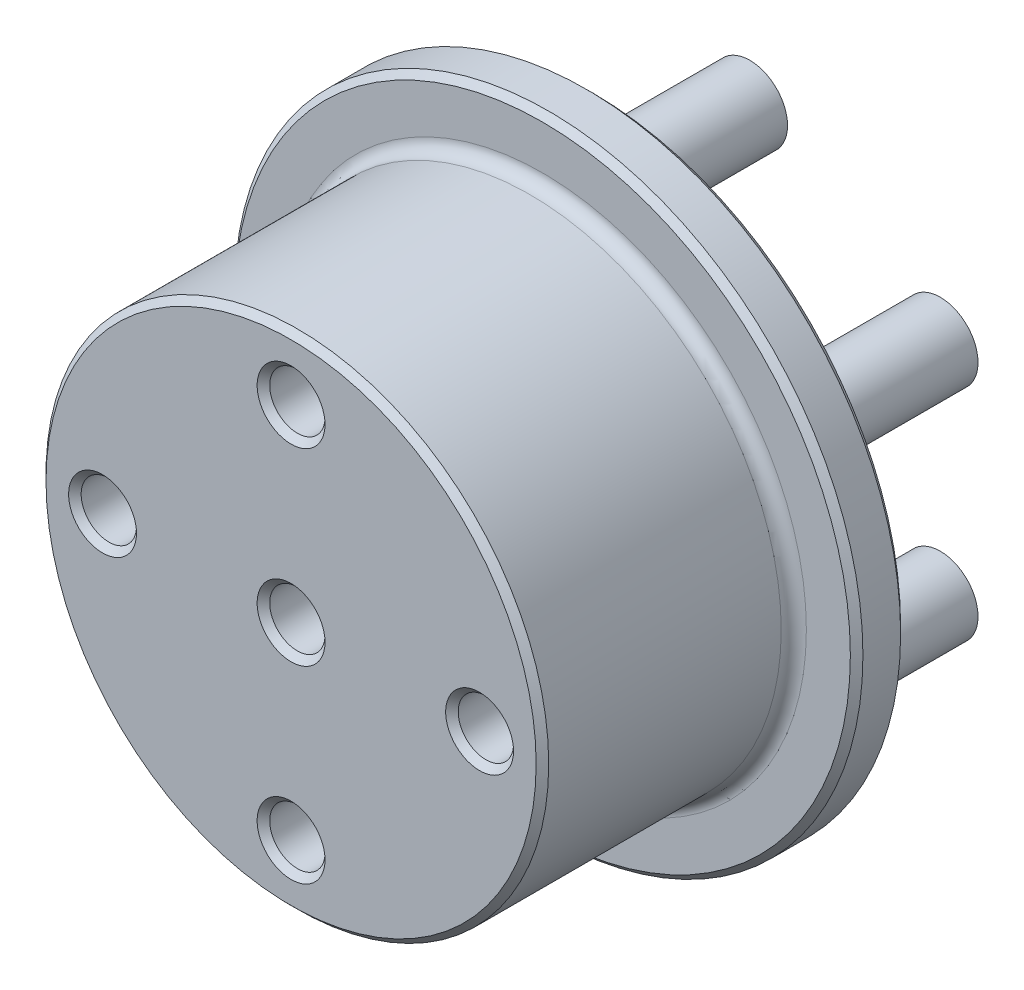
ISO-10303-21;
HEADER;
FILE_DESCRIPTION(('STEP AP214'),'2;1');
FILE_NAME('part.step','',(''),(''),'','','');
FILE_SCHEMA(('AUTOMOTIVE_DESIGN { 1 0 10303 214 1 1 1 1 }'));
ENDSEC;
DATA;
#1=APPLICATION_CONTEXT('core data for automotive mechanical design processes');
#2=APPLICATION_PROTOCOL_DEFINITION('international standard','automotive_design',2000,#1);
#3=PRODUCT_CONTEXT('',#1,'mechanical');
#4=PRODUCT('Part','Part','',(#3));
#5=PRODUCT_RELATED_PRODUCT_CATEGORY('part','',(#4));
#6=PRODUCT_DEFINITION_FORMATION('','',#4);
#7=PRODUCT_DEFINITION_CONTEXT('part definition',#1,'design');
#8=PRODUCT_DEFINITION('design','',#6,#7);
#9=PRODUCT_DEFINITION_SHAPE('','',#8);
#10=(LENGTH_UNIT() NAMED_UNIT(*) SI_UNIT(.MILLI.,.METRE.));
#11=(NAMED_UNIT(*) PLANE_ANGLE_UNIT() SI_UNIT($,.RADIAN.));
#12=(NAMED_UNIT(*) SI_UNIT($,.STERADIAN.) SOLID_ANGLE_UNIT());
#13=UNCERTAINTY_MEASURE_WITH_UNIT(LENGTH_MEASURE(1.E-05),#10,'distance_accuracy_value','');
#14=(GEOMETRIC_REPRESENTATION_CONTEXT(3) GLOBAL_UNCERTAINTY_ASSIGNED_CONTEXT((#13)) GLOBAL_UNIT_ASSIGNED_CONTEXT((#10,
#11,#12)) REPRESENTATION_CONTEXT('',''));
#15=CARTESIAN_POINT('',(0.,0.,0.));
#16=DIRECTION('',(0.,0.,1.));
#17=DIRECTION('',(1.,0.,0.));
#18=AXIS2_PLACEMENT_3D('',#15,#16,#17);
#19=CARTESIAN_POINT('',(0.,0.,-4.));
#20=DIRECTION('',(0.,0.,1.));
#21=DIRECTION('',(1.,0.,0.));
#22=AXIS2_PLACEMENT_3D('',#19,#20,#21);
#23=CYLINDRICAL_SURFACE('',#22,25.);
#24=CARTESIAN_POINT('',(0.,0.,-3.49999999999999));
#25=DIRECTION('',(0.,0.,1.));
#26=DIRECTION('',(1.,0.,0.));
#27=AXIS2_PLACEMENT_3D('',#24,#25,#26);
#28=CIRCLE('',#27,25.);
#29=CARTESIAN_POINT('',(25.,0.,-3.49999999999999));
#30=VERTEX_POINT('',#29);
#31=EDGE_CURVE('E186',#30,#30,#28,.T.);
#32=ORIENTED_EDGE('',*,*,#31,.T.);
#33=EDGE_LOOP('',(#32));
#34=FACE_BOUND('',#33,.T.);
#35=CARTESIAN_POINT('',(0.,0.,-0.49999999999999));
#36=DIRECTION('',(0.,0.,1.));
#37=DIRECTION('',(1.,0.,0.));
#38=AXIS2_PLACEMENT_3D('',#35,#36,#37);
#39=CIRCLE('',#38,25.);
#40=CARTESIAN_POINT('',(25.,0.,-0.49999999999999));
#41=VERTEX_POINT('',#40);
#42=EDGE_CURVE('E182',#41,#41,#39,.F.);
#43=ORIENTED_EDGE('',*,*,#42,.T.);
#44=EDGE_LOOP('',(#43));
#45=FACE_BOUND('',#44,.T.);
#46=ADVANCED_FACE('F47',(#34,#45),#23,.T.);
#47=CARTESIAN_POINT('',(0.,0.,-4.));
#48=DIRECTION('',(0.,0.,1.));
#49=DIRECTION('',(1.,0.,0.));
#50=AXIS2_PLACEMENT_3D('',#47,#48,#49);
#51=PLANE('',#50);
#52=CARTESIAN_POINT('',(0.,0.,-4.));
#53=DIRECTION('',(0.,0.,1.));
#54=DIRECTION('',(1.,0.,0.));
#55=AXIS2_PLACEMENT_3D('',#52,#53,#54);
#56=CIRCLE('',#55,24.5);
#57=CARTESIAN_POINT('',(24.5,0.,-4.));
#58=VERTEX_POINT('',#57);
#59=EDGE_CURVE('E194',#58,#58,#56,.F.);
#60=ORIENTED_EDGE('',*,*,#59,.T.);
#61=EDGE_LOOP('',(#60));
#62=FACE_BOUND('',#61,.T.);
#63=CARTESIAN_POINT('',(0.,0.,-4.));
#64=DIRECTION('',(0.,0.,1.));
#65=DIRECTION('',(1.,0.,0.));
#66=AXIS2_PLACEMENT_3D('',#63,#64,#65);
#67=CIRCLE('',#66,10.7);
#68=CARTESIAN_POINT('',(10.7,0.,-4.));
#69=VERTEX_POINT('',#68);
#70=EDGE_CURVE('E190',#69,#69,#67,.T.);
#71=ORIENTED_EDGE('',*,*,#70,.T.);
#72=EDGE_LOOP('',(#71));
#73=FACE_BOUND('',#72,.T.);
#74=CARTESIAN_POINT('',(15.1554445662276,8.75000000000018,-4.));
#75=DIRECTION('',(0.,0.,1.));
#76=DIRECTION('',(1.,0.,0.));
#77=AXIS2_PLACEMENT_3D('',#74,#75,#76);
#78=CIRCLE('',#77,4.);
#79=CARTESIAN_POINT('',(19.1554445662276,8.75000000000018,-4.));
#80=VERTEX_POINT('',#79);
#81=EDGE_CURVE('E158',#80,#80,#78,.T.);
#82=ORIENTED_EDGE('',*,*,#81,.T.);
#83=EDGE_LOOP('',(#82));
#84=FACE_BOUND('',#83,.T.);
#85=CARTESIAN_POINT('',(0.,17.5,-4.));
#86=DIRECTION('',(0.,0.,1.));
#87=DIRECTION('',(1.,0.,0.));
#88=AXIS2_PLACEMENT_3D('',#85,#86,#87);
#89=CIRCLE('',#88,4.);
#90=CARTESIAN_POINT('',(4.,17.5,-4.));
#91=VERTEX_POINT('',#90);
#92=EDGE_CURVE('E154',#91,#91,#89,.T.);
#93=ORIENTED_EDGE('',*,*,#92,.T.);
#94=EDGE_LOOP('',(#93));
#95=FACE_BOUND('',#94,.T.);
#96=CARTESIAN_POINT('',(-15.1554445662277,8.74999999999997,-4.));
#97=DIRECTION('',(0.,0.,1.));
#98=DIRECTION('',(1.,0.,0.));
#99=AXIS2_PLACEMENT_3D('',#96,#97,#98);
#100=CIRCLE('',#99,4.);
#101=CARTESIAN_POINT('',(-11.1554445662277,8.74999999999997,-4.));
#102=VERTEX_POINT('',#101);
#103=EDGE_CURVE('E150',#102,#102,#100,.T.);
#104=ORIENTED_EDGE('',*,*,#103,.T.);
#105=EDGE_LOOP('',(#104));
#106=FACE_BOUND('',#105,.T.);
#107=CARTESIAN_POINT('',(-15.1554445662276,-8.75000000000007,-4.));
#108=DIRECTION('',(0.,0.,1.));
#109=DIRECTION('',(1.,0.,0.));
#110=AXIS2_PLACEMENT_3D('',#107,#108,#109);
#111=CIRCLE('',#110,4.);
#112=CARTESIAN_POINT('',(-11.1554445662276,-8.75000000000007,-4.));
#113=VERTEX_POINT('',#112);
#114=EDGE_CURVE('E146',#113,#113,#111,.T.);
#115=ORIENTED_EDGE('',*,*,#114,.T.);
#116=EDGE_LOOP('',(#115));
#117=FACE_BOUND('',#116,.T.);
#118=CARTESIAN_POINT('',(1.2220184685951E-13,-17.5,-4.));
#119=DIRECTION('',(0.,0.,1.));
#120=DIRECTION('',(1.,0.,0.));
#121=AXIS2_PLACEMENT_3D('',#118,#119,#120);
#122=CIRCLE('',#121,4.);
#123=CARTESIAN_POINT('',(4.00000000000012,-17.5,-4.));
#124=VERTEX_POINT('',#123);
#125=EDGE_CURVE('E142',#124,#124,#122,.T.);
#126=ORIENTED_EDGE('',*,*,#125,.T.);
#127=EDGE_LOOP('',(#126));
#128=FACE_BOUND('',#127,.T.);
#129=CARTESIAN_POINT('',(15.1554445662277,-8.75000000000001,-4.));
#130=DIRECTION('',(0.,0.,1.));
#131=DIRECTION('',(1.,0.,0.));
#132=AXIS2_PLACEMENT_3D('',#129,#130,#131);
#133=CIRCLE('',#132,4.);
#134=CARTESIAN_POINT('',(19.1554445662277,-8.75000000000001,-4.));
#135=VERTEX_POINT('',#134);
#136=EDGE_CURVE('E138',#135,#135,#133,.T.);
#137=ORIENTED_EDGE('',*,*,#136,.T.);
#138=EDGE_LOOP('',(#137));
#139=FACE_BOUND('',#138,.T.);
#140=ADVANCED_FACE('F274',(#62,#73,#84,#95,#106,#117,#128,#139),#51,.F.);
#141=CARTESIAN_POINT('',(0.,0.,0.));
#142=DIRECTION('',(0.,0.,1.));
#143=DIRECTION('',(1.,0.,0.));
#144=AXIS2_PLACEMENT_3D('',#141,#142,#143);
#145=PLANE('',#144);
#146=CARTESIAN_POINT('',(0.,0.,0.));
#147=DIRECTION('',(0.,0.,1.));
#148=DIRECTION('',(1.,0.,0.));
#149=AXIS2_PLACEMENT_3D('',#146,#147,#148);
#150=CIRCLE('',#149,24.5);
#151=CARTESIAN_POINT('',(24.5,0.,0.));
#152=VERTEX_POINT('',#151);
#153=EDGE_CURVE('E210',#152,#152,#150,.T.);
#154=ORIENTED_EDGE('',*,*,#153,.T.);
#155=EDGE_LOOP('',(#154));
#156=FACE_BOUND('',#155,.T.);
#157=CARTESIAN_POINT('',(0.,0.,0.));
#158=DIRECTION('',(0.,0.,1.));
#159=DIRECTION('',(1.,0.,0.));
#160=AXIS2_PLACEMENT_3D('',#157,#158,#159);
#161=CIRCLE('',#160,21.);
#162=CARTESIAN_POINT('',(21.,0.,0.));
#163=VERTEX_POINT('',#162);
#164=EDGE_CURVE('E130',#163,#163,#161,.F.);
#165=ORIENTED_EDGE('',*,*,#164,.T.);
#166=EDGE_LOOP('',(#165));
#167=FACE_BOUND('',#166,.T.);
#168=ADVANCED_FACE('F281',(#156,#167),#145,.T.);
#169=CARTESIAN_POINT('',(0.,0.,20.));
#170=DIRECTION('',(0.,0.,-1.));
#171=DIRECTION('',(-1.,0.,0.));
#172=AXIS2_PLACEMENT_3D('',#169,#170,#171);
#173=CYLINDRICAL_SURFACE('',#172,20.);
#174=CARTESIAN_POINT('',(0.,0.,19.5));
#175=DIRECTION('',(0.,0.,1.));
#176=DIRECTION('',(1.,0.,0.));
#177=AXIS2_PLACEMENT_3D('',#174,#175,#176);
#178=CIRCLE('',#177,20.);
#179=CARTESIAN_POINT('',(20.,0.,19.5));
#180=VERTEX_POINT('',#179);
#181=EDGE_CURVE('E238',#180,#180,#178,.F.);
#182=ORIENTED_EDGE('',*,*,#181,.T.);
#183=EDGE_LOOP('',(#182));
#184=FACE_BOUND('',#183,.T.);
#185=CARTESIAN_POINT('',(0.,0.,1.));
#186=DIRECTION('',(0.,0.,1.));
#187=DIRECTION('',(1.,0.,0.));
#188=AXIS2_PLACEMENT_3D('',#185,#186,#187);
#189=CIRCLE('',#188,20.);
#190=CARTESIAN_POINT('',(20.,0.,1.));
#191=VERTEX_POINT('',#190);
#192=EDGE_CURVE('E107',#191,#191,#189,.T.);
#193=ORIENTED_EDGE('',*,*,#192,.T.);
#194=EDGE_LOOP('',(#193));
#195=FACE_BOUND('',#194,.T.);
#196=ADVANCED_FACE('F455',(#184,#195),#173,.T.);
#197=CARTESIAN_POINT('',(0.,0.,20.));
#198=DIRECTION('',(0.,0.,1.));
#199=DIRECTION('',(1.,0.,0.));
#200=AXIS2_PLACEMENT_3D('',#197,#198,#199);
#201=PLANE('',#200);
#202=CARTESIAN_POINT('',(0.,0.,20.));
#203=DIRECTION('',(0.,0.,1.));
#204=DIRECTION('',(1.,0.,0.));
#205=AXIS2_PLACEMENT_3D('',#202,#203,#204);
#206=CIRCLE('',#205,19.5);
#207=CARTESIAN_POINT('',(19.5,0.,20.));
#208=VERTEX_POINT('',#207);
#209=EDGE_CURVE('E234',#208,#208,#206,.T.);
#210=ORIENTED_EDGE('',*,*,#209,.T.);
#211=EDGE_LOOP('',(#210));
#212=FACE_BOUND('',#211,.T.);
#213=CARTESIAN_POINT('',(-15.,0.,20.));
#214=DIRECTION('',(0.,0.,1.));
#215=DIRECTION('',(1.,0.,0.));
#216=AXIS2_PLACEMENT_3D('',#213,#214,#215);
#217=CIRCLE('',#216,2.70000000000002);
#218=CARTESIAN_POINT('',(-12.3,0.,20.));
#219=VERTEX_POINT('',#218);
#220=EDGE_CURVE('E230',#219,#219,#217,.F.);
#221=ORIENTED_EDGE('',*,*,#220,.T.);
#222=EDGE_LOOP('',(#221));
#223=FACE_BOUND('',#222,.T.);
#224=CARTESIAN_POINT('',(0.,-15.,20.));
#225=DIRECTION('',(0.,0.,1.));
#226=DIRECTION('',(1.,0.,0.));
#227=AXIS2_PLACEMENT_3D('',#224,#225,#226);
#228=CIRCLE('',#227,2.70000000000002);
#229=CARTESIAN_POINT('',(2.70000000000002,-15.,20.));
#230=VERTEX_POINT('',#229);
#231=EDGE_CURVE('E226',#230,#230,#228,.F.);
#232=ORIENTED_EDGE('',*,*,#231,.T.);
#233=EDGE_LOOP('',(#232));
#234=FACE_BOUND('',#233,.T.);
#235=CARTESIAN_POINT('',(15.,0.,20.));
#236=DIRECTION('',(0.,0.,1.));
#237=DIRECTION('',(1.,0.,0.));
#238=AXIS2_PLACEMENT_3D('',#235,#236,#237);
#239=CIRCLE('',#238,2.70000000000002);
#240=CARTESIAN_POINT('',(17.7,0.,20.));
#241=VERTEX_POINT('',#240);
#242=EDGE_CURVE('E222',#241,#241,#239,.F.);
#243=ORIENTED_EDGE('',*,*,#242,.T.);
#244=EDGE_LOOP('',(#243));
#245=FACE_BOUND('',#244,.T.);
#246=CARTESIAN_POINT('',(0.,15.,20.));
#247=DIRECTION('',(0.,0.,1.));
#248=DIRECTION('',(1.,0.,0.));
#249=AXIS2_PLACEMENT_3D('',#246,#247,#248);
#250=CIRCLE('',#249,2.70000000000002);
#251=CARTESIAN_POINT('',(2.70000000000002,15.,20.));
#252=VERTEX_POINT('',#251);
#253=EDGE_CURVE('E218',#252,#252,#250,.F.);
#254=ORIENTED_EDGE('',*,*,#253,.T.);
#255=EDGE_LOOP('',(#254));
#256=FACE_BOUND('',#255,.T.);
#257=CARTESIAN_POINT('',(0.,0.,20.));
#258=DIRECTION('',(0.,0.,1.));
#259=DIRECTION('',(1.,0.,0.));
#260=AXIS2_PLACEMENT_3D('',#257,#258,#259);
#261=CIRCLE('',#260,2.70000000000002);
#262=CARTESIAN_POINT('',(2.70000000000002,0.,20.));
#263=VERTEX_POINT('',#262);
#264=EDGE_CURVE('E214',#263,#263,#261,.F.);
#265=ORIENTED_EDGE('',*,*,#264,.T.);
#266=EDGE_LOOP('',(#265));
#267=FACE_BOUND('',#266,.T.);
#268=ADVANCED_FACE('F291',(#212,#223,#234,#245,#256,#267),#201,.T.);
#269=CARTESIAN_POINT('',(0.,0.,1.));
#270=DIRECTION('',(0.,0.,1.));
#271=DIRECTION('',(1.,0.,0.));
#272=AXIS2_PLACEMENT_3D('',#269,#270,#271);
#273=TOROIDAL_SURFACE('',#272,21.,1.);
#274=ORIENTED_EDGE('',*,*,#164,.F.);
#275=EDGE_LOOP('',(#274));
#276=FACE_BOUND('',#275,.T.);
#277=ORIENTED_EDGE('',*,*,#192,.F.);
#278=EDGE_LOOP('',(#277));
#279=FACE_BOUND('',#278,.T.);
#280=ADVANCED_FACE('F287',(#276,#279),#273,.F.);
#281=CARTESIAN_POINT('',(0.,0.,1.));
#282=DIRECTION('',(0.,0.,-1.));
#283=DIRECTION('',(-1.,0.,0.));
#284=AXIS2_PLACEMENT_3D('',#281,#282,#283);
#285=CYLINDRICAL_SURFACE('',#284,10.2);
#286=CARTESIAN_POINT('',(0.,0.,-3.49999999999999));
#287=DIRECTION('',(0.,0.,1.));
#288=DIRECTION('',(1.,0.,0.));
#289=AXIS2_PLACEMENT_3D('',#286,#287,#288);
#290=CIRCLE('',#289,10.2);
#291=CARTESIAN_POINT('',(10.2,0.,-3.49999999999999));
#292=VERTEX_POINT('',#291);
#293=EDGE_CURVE('E202',#292,#292,#290,.F.);
#294=ORIENTED_EDGE('',*,*,#293,.T.);
#295=EDGE_LOOP('',(#294));
#296=FACE_BOUND('',#295,.T.);
#297=CARTESIAN_POINT('',(0.,0.,0.500000000000003));
#298=DIRECTION('',(0.,0.,-1.));
#299=DIRECTION('',(-1.,0.,0.));
#300=AXIS2_PLACEMENT_3D('',#297,#298,#299);
#301=CIRCLE('',#300,10.2);
#302=CARTESIAN_POINT('',(-10.2,0.,0.500000000000003));
#303=VERTEX_POINT('',#302);
#304=EDGE_CURVE('E198',#303,#303,#301,.F.);
#305=ORIENTED_EDGE('',*,*,#304,.T.);
#306=EDGE_LOOP('',(#305));
#307=FACE_BOUND('',#306,.T.);
#308=ADVANCED_FACE('F290',(#296,#307),#285,.F.);
#309=CARTESIAN_POINT('',(0.,0.,1.));
#310=DIRECTION('',(0.,0.,-1.));
#311=DIRECTION('',(-1.,0.,0.));
#312=AXIS2_PLACEMENT_3D('',#309,#310,#311);
#313=PLANE('',#312);
#314=CARTESIAN_POINT('',(0.,0.,1.));
#315=DIRECTION('',(0.,0.,-1.));
#316=DIRECTION('',(-1.,0.,0.));
#317=AXIS2_PLACEMENT_3D('',#314,#315,#316);
#318=CIRCLE('',#317,9.69999999999999);
#319=CARTESIAN_POINT('',(-9.69999999999999,0.,1.));
#320=VERTEX_POINT('',#319);
#321=EDGE_CURVE('E206',#320,#320,#318,.T.);
#322=ORIENTED_EDGE('',*,*,#321,.T.);
#323=EDGE_LOOP('',(#322));
#324=FACE_BOUND('',#323,.T.);
#325=ADVANCED_FACE('F421',(#324),#313,.T.);
#326=CARTESIAN_POINT('',(-15.1554445662277,8.74999999999997,-16.5));
#327=DIRECTION('',(0.,0.,1.));
#328=DIRECTION('',(1.,0.,0.));
#329=AXIS2_PLACEMENT_3D('',#326,#327,#328);
#330=CYLINDRICAL_SURFACE('',#329,3.);
#331=CARTESIAN_POINT('',(-15.1554445662277,8.74999999999997,-5.));
#332=DIRECTION('',(0.,0.,1.));
#333=DIRECTION('',(1.,0.,0.));
#334=AXIS2_PLACEMENT_3D('',#331,#332,#333);
#335=CIRCLE('',#334,3.);
#336=CARTESIAN_POINT('',(-12.1554445662277,8.74999999999997,-5.));
#337=VERTEX_POINT('',#336);
#338=EDGE_CURVE('E166',#337,#337,#335,.F.);
#339=ORIENTED_EDGE('',*,*,#338,.T.);
#340=EDGE_LOOP('',(#339));
#341=FACE_BOUND('',#340,.T.);
#342=CARTESIAN_POINT('',(-15.1554445662277,8.74999999999997,-16.5));
#343=DIRECTION('',(0.,0.,-1.));
#344=DIRECTION('',(-1.,0.,0.));
#345=AXIS2_PLACEMENT_3D('',#342,#343,#344);
#346=CIRCLE('',#345,3.);
#347=CARTESIAN_POINT('',(-18.1554445662277,8.74999999999997,-16.5));
#348=VERTEX_POINT('',#347);
#349=EDGE_CURVE('E108',#348,#348,#346,.T.);
#350=ORIENTED_EDGE('',*,*,#349,.F.);
#351=EDGE_LOOP('',(#350));
#352=FACE_BOUND('',#351,.T.);
#353=ADVANCED_FACE('F417',(#341,#352),#330,.T.);
#354=CARTESIAN_POINT('',(-15.1554445662277,8.74999999999997,-16.5));
#355=DIRECTION('',(0.,0.,-1.));
#356=DIRECTION('',(-1.,0.,0.));
#357=AXIS2_PLACEMENT_3D('',#354,#355,#356);
#358=PLANE('',#357);
#359=ORIENTED_EDGE('',*,*,#349,.T.);
#360=EDGE_LOOP('',(#359));
#361=FACE_BOUND('',#360,.T.);
#362=ADVANCED_FACE('F420',(#361),#358,.T.);
#363=CARTESIAN_POINT('',(-15.1554445662276,-8.75000000000007,-16.5));
#364=DIRECTION('',(0.,0.,1.));
#365=DIRECTION('',(1.,0.,0.));
#366=AXIS2_PLACEMENT_3D('',#363,#364,#365);
#367=CYLINDRICAL_SURFACE('',#366,3.);
#368=CARTESIAN_POINT('',(-15.1554445662276,-8.75000000000007,-5.));
#369=DIRECTION('',(0.,0.,1.));
#370=DIRECTION('',(1.,0.,0.));
#371=AXIS2_PLACEMENT_3D('',#368,#369,#370);
#372=CIRCLE('',#371,3.);
#373=CARTESIAN_POINT('',(-12.1554445662276,-8.75000000000007,-5.));
#374=VERTEX_POINT('',#373);
#375=EDGE_CURVE('E170',#374,#374,#372,.F.);
#376=ORIENTED_EDGE('',*,*,#375,.T.);
#377=EDGE_LOOP('',(#376));
#378=FACE_BOUND('',#377,.T.);
#379=CARTESIAN_POINT('',(-15.1554445662276,-8.75000000000007,-16.5));
#380=DIRECTION('',(0.,0.,-1.));
#381=DIRECTION('',(-1.,0.,0.));
#382=AXIS2_PLACEMENT_3D('',#379,#380,#381);
#383=CIRCLE('',#382,3.);
#384=CARTESIAN_POINT('',(-18.1554445662276,-8.75000000000007,-16.5));
#385=VERTEX_POINT('',#384);
#386=EDGE_CURVE('E116',#385,#385,#383,.T.);
#387=ORIENTED_EDGE('',*,*,#386,.F.);
#388=EDGE_LOOP('',(#387));
#389=FACE_BOUND('',#388,.T.);
#390=ADVANCED_FACE('F425',(#378,#389),#367,.T.);
#391=CARTESIAN_POINT('',(-15.1554445662276,-8.75000000000007,-16.5));
#392=DIRECTION('',(0.,0.,-1.));
#393=DIRECTION('',(-1.,0.,0.));
#394=AXIS2_PLACEMENT_3D('',#391,#392,#393);
#395=PLANE('',#394);
#396=ORIENTED_EDGE('',*,*,#386,.T.);
#397=EDGE_LOOP('',(#396));
#398=FACE_BOUND('',#397,.T.);
#399=ADVANCED_FACE('F429',(#398),#395,.T.);
#400=CARTESIAN_POINT('',(1.2220184685951E-13,-17.5,-16.5));
#401=DIRECTION('',(0.,0.,1.));
#402=DIRECTION('',(1.,0.,0.));
#403=AXIS2_PLACEMENT_3D('',#400,#401,#402);
#404=CYLINDRICAL_SURFACE('',#403,3.);
#405=CARTESIAN_POINT('',(1.2220184685951E-13,-17.5,-5.));
#406=DIRECTION('',(0.,0.,1.));
#407=DIRECTION('',(1.,0.,0.));
#408=AXIS2_PLACEMENT_3D('',#405,#406,#407);
#409=CIRCLE('',#408,3.);
#410=CARTESIAN_POINT('',(3.00000000000012,-17.5,-5.));
#411=VERTEX_POINT('',#410);
#412=EDGE_CURVE('E174',#411,#411,#409,.F.);
#413=ORIENTED_EDGE('',*,*,#412,.T.);
#414=EDGE_LOOP('',(#413));
#415=FACE_BOUND('',#414,.T.);
#416=CARTESIAN_POINT('',(1.2220184685951E-13,-17.5,-16.5));
#417=DIRECTION('',(0.,0.,-1.));
#418=DIRECTION('',(-1.,0.,0.));
#419=AXIS2_PLACEMENT_3D('',#416,#417,#418);
#420=CIRCLE('',#419,3.);
#421=CARTESIAN_POINT('',(-2.99999999999988,-17.5,-16.5));
#422=VERTEX_POINT('',#421);
#423=EDGE_CURVE('E120',#422,#422,#420,.T.);
#424=ORIENTED_EDGE('',*,*,#423,.F.);
#425=EDGE_LOOP('',(#424));
#426=FACE_BOUND('',#425,.T.);
#427=ADVANCED_FACE('F433',(#415,#426),#404,.T.);
#428=CARTESIAN_POINT('',(1.2220184685951E-13,-17.5,-16.5));
#429=DIRECTION('',(0.,0.,-1.));
#430=DIRECTION('',(-1.,0.,0.));
#431=AXIS2_PLACEMENT_3D('',#428,#429,#430);
#432=PLANE('',#431);
#433=ORIENTED_EDGE('',*,*,#423,.T.);
#434=EDGE_LOOP('',(#433));
#435=FACE_BOUND('',#434,.T.);
#436=ADVANCED_FACE('F412',(#435),#432,.T.);
#437=CARTESIAN_POINT('',(15.1554445662276,8.75000000000018,-16.5));
#438=DIRECTION('',(0.,0.,1.));
#439=DIRECTION('',(1.,0.,0.));
#440=AXIS2_PLACEMENT_3D('',#437,#438,#439);
#441=CYLINDRICAL_SURFACE('',#440,3.);
#442=CARTESIAN_POINT('',(15.1554445662276,8.75000000000018,-5.));
#443=DIRECTION('',(0.,0.,1.));
#444=DIRECTION('',(1.,0.,0.));
#445=AXIS2_PLACEMENT_3D('',#442,#443,#444);
#446=CIRCLE('',#445,3.);
#447=CARTESIAN_POINT('',(18.1554445662276,8.75000000000018,-5.));
#448=VERTEX_POINT('',#447);
#449=EDGE_CURVE('E134',#448,#448,#446,.F.);
#450=ORIENTED_EDGE('',*,*,#449,.T.);
#451=EDGE_LOOP('',(#450));
#452=FACE_BOUND('',#451,.T.);
#453=CARTESIAN_POINT('',(15.1554445662276,8.75000000000018,-16.5));
#454=DIRECTION('',(0.,0.,-1.));
#455=DIRECTION('',(-1.,0.,0.));
#456=AXIS2_PLACEMENT_3D('',#453,#454,#455);
#457=CIRCLE('',#456,3.);
#458=CARTESIAN_POINT('',(12.1554445662276,8.75000000000018,-16.5));
#459=VERTEX_POINT('',#458);
#460=EDGE_CURVE('E102',#459,#459,#457,.T.);
#461=ORIENTED_EDGE('',*,*,#460,.F.);
#462=EDGE_LOOP('',(#461));
#463=FACE_BOUND('',#462,.T.);
#464=ADVANCED_FACE('F409',(#452,#463),#441,.T.);
#465=CARTESIAN_POINT('',(15.1554445662276,8.75000000000018,-16.5));
#466=DIRECTION('',(0.,0.,-1.));
#467=DIRECTION('',(-1.,0.,0.));
#468=AXIS2_PLACEMENT_3D('',#465,#466,#467);
#469=PLANE('',#468);
#470=ORIENTED_EDGE('',*,*,#460,.T.);
#471=EDGE_LOOP('',(#470));
#472=FACE_BOUND('',#471,.T.);
#473=ADVANCED_FACE('F407',(#472),#469,.T.);
#474=CARTESIAN_POINT('',(0.,17.5,-16.5));
#475=DIRECTION('',(0.,0.,1.));
#476=DIRECTION('',(1.,0.,0.));
#477=AXIS2_PLACEMENT_3D('',#474,#475,#476);
#478=CYLINDRICAL_SURFACE('',#477,3.);
#479=CARTESIAN_POINT('',(0.,17.5,-5.));
#480=DIRECTION('',(0.,0.,1.));
#481=DIRECTION('',(1.,0.,0.));
#482=AXIS2_PLACEMENT_3D('',#479,#480,#481);
#483=CIRCLE('',#482,3.);
#484=CARTESIAN_POINT('',(3.,17.5,-5.));
#485=VERTEX_POINT('',#484);
#486=EDGE_CURVE('E162',#485,#485,#483,.F.);
#487=ORIENTED_EDGE('',*,*,#486,.T.);
#488=EDGE_LOOP('',(#487));
#489=FACE_BOUND('',#488,.T.);
#490=CARTESIAN_POINT('',(0.,17.5,-16.5));
#491=DIRECTION('',(0.,0.,-1.));
#492=DIRECTION('',(-1.,0.,0.));
#493=AXIS2_PLACEMENT_3D('',#490,#491,#492);
#494=CIRCLE('',#493,3.);
#495=CARTESIAN_POINT('',(-3.,17.5,-16.5));
#496=VERTEX_POINT('',#495);
#497=EDGE_CURVE('E103',#496,#496,#494,.T.);
#498=ORIENTED_EDGE('',*,*,#497,.F.);
#499=EDGE_LOOP('',(#498));
#500=FACE_BOUND('',#499,.T.);
#501=ADVANCED_FACE('F403',(#489,#500),#478,.T.);
#502=CARTESIAN_POINT('',(0.,17.5,-16.5));
#503=DIRECTION('',(0.,0.,-1.));
#504=DIRECTION('',(-1.,0.,0.));
#505=AXIS2_PLACEMENT_3D('',#502,#503,#504);
#506=PLANE('',#505);
#507=ORIENTED_EDGE('',*,*,#497,.T.);
#508=EDGE_LOOP('',(#507));
#509=FACE_BOUND('',#508,.T.);
#510=ADVANCED_FACE('F399',(#509),#506,.T.);
#511=CARTESIAN_POINT('',(15.1554445662277,-8.75000000000001,-16.5));
#512=DIRECTION('',(0.,0.,1.));
#513=DIRECTION('',(1.,0.,0.));
#514=AXIS2_PLACEMENT_3D('',#511,#512,#513);
#515=CYLINDRICAL_SURFACE('',#514,3.);
#516=CARTESIAN_POINT('',(15.1554445662277,-8.75000000000001,-5.));
#517=DIRECTION('',(0.,0.,1.));
#518=DIRECTION('',(1.,0.,0.));
#519=AXIS2_PLACEMENT_3D('',#516,#517,#518);
#520=CIRCLE('',#519,3.);
#521=CARTESIAN_POINT('',(18.1554445662277,-8.75000000000001,-5.));
#522=VERTEX_POINT('',#521);
#523=EDGE_CURVE('E178',#522,#522,#520,.F.);
#524=ORIENTED_EDGE('',*,*,#523,.T.);
#525=EDGE_LOOP('',(#524));
#526=FACE_BOUND('',#525,.T.);
#527=CARTESIAN_POINT('',(15.1554445662277,-8.75000000000001,-16.5));
#528=DIRECTION('',(0.,0.,-1.));
#529=DIRECTION('',(-1.,0.,0.));
#530=AXIS2_PLACEMENT_3D('',#527,#528,#529);
#531=CIRCLE('',#530,3.);
#532=CARTESIAN_POINT('',(12.1554445662277,-8.75000000000001,-16.5));
#533=VERTEX_POINT('',#532);
#534=EDGE_CURVE('E112',#533,#533,#531,.T.);
#535=ORIENTED_EDGE('',*,*,#534,.F.);
#536=EDGE_LOOP('',(#535));
#537=FACE_BOUND('',#536,.T.);
#538=ADVANCED_FACE('F402',(#526,#537),#515,.T.);
#539=CARTESIAN_POINT('',(15.1554445662277,-8.75000000000001,-16.5));
#540=DIRECTION('',(0.,0.,-1.));
#541=DIRECTION('',(-1.,0.,0.));
#542=AXIS2_PLACEMENT_3D('',#539,#540,#541);
#543=PLANE('',#542);
#544=ORIENTED_EDGE('',*,*,#534,.T.);
#545=EDGE_LOOP('',(#544));
#546=FACE_BOUND('',#545,.T.);
#547=ADVANCED_FACE('F398',(#546),#543,.T.);
#548=CARTESIAN_POINT('',(-15.,0.,12.));
#549=DIRECTION('',(0.,0.,1.));
#550=DIRECTION('',(1.,0.,0.));
#551=AXIS2_PLACEMENT_3D('',#548,#549,#550);
#552=CONICAL_SURFACE('',#551,2.2,1.02974425867665);
#553=CARTESIAN_POINT('',(-15.,0.,10.6781066381394));
#554=VERTEX_POINT('',#553);
#555=VERTEX_LOOP('',#554);
#556=FACE_BOUND('',#555,.T.);
#557=CARTESIAN_POINT('',(-15.,0.,12.));
#558=DIRECTION('',(0.,0.,1.));
#559=DIRECTION('',(1.,0.,0.));
#560=AXIS2_PLACEMENT_3D('',#557,#558,#559);
#561=CIRCLE('',#560,2.2);
#562=CARTESIAN_POINT('',(-12.8,0.,12.));
#563=VERTEX_POINT('',#562);
#564=EDGE_CURVE('E98',#563,#563,#561,.T.);
#565=ORIENTED_EDGE('',*,*,#564,.T.);
#566=EDGE_LOOP('',(#565));
#567=FACE_BOUND('',#566,.T.);
#568=ADVANCED_FACE('F392',(#556,#567),#552,.F.);
#569=CARTESIAN_POINT('',(-15.,0.,20.));
#570=DIRECTION('',(0.,0.,1.));
#571=DIRECTION('',(1.,0.,0.));
#572=AXIS2_PLACEMENT_3D('',#569,#570,#571);
#573=CYLINDRICAL_SURFACE('',#572,2.2);
#574=CARTESIAN_POINT('',(-15.,0.,19.5));
#575=DIRECTION('',(0.,0.,1.));
#576=DIRECTION('',(1.,0.,0.));
#577=AXIS2_PLACEMENT_3D('',#574,#575,#576);
#578=CIRCLE('',#577,2.2);
#579=CARTESIAN_POINT('',(-12.8,0.,19.5));
#580=VERTEX_POINT('',#579);
#581=EDGE_CURVE('E242',#580,#580,#578,.T.);
#582=ORIENTED_EDGE('',*,*,#581,.T.);
#583=EDGE_LOOP('',(#582));
#584=FACE_BOUND('',#583,.T.);
#585=ORIENTED_EDGE('',*,*,#564,.F.);
#586=EDGE_LOOP('',(#585));
#587=FACE_BOUND('',#586,.T.);
#588=ADVANCED_FACE('F385',(#584,#587),#573,.F.);
#589=CARTESIAN_POINT('',(0.,-15.,12.));
#590=DIRECTION('',(0.,0.,1.));
#591=DIRECTION('',(1.,0.,0.));
#592=AXIS2_PLACEMENT_3D('',#589,#590,#591);
#593=CONICAL_SURFACE('',#592,2.2,1.02974425867665);
#594=CARTESIAN_POINT('',(0.,-15.,10.6781066381394));
#595=VERTEX_POINT('',#594);
#596=VERTEX_LOOP('',#595);
#597=FACE_BOUND('',#596,.T.);
#598=CARTESIAN_POINT('',(0.,-15.,12.));
#599=DIRECTION('',(0.,0.,1.));
#600=DIRECTION('',(1.,0.,0.));
#601=AXIS2_PLACEMENT_3D('',#598,#599,#600);
#602=CIRCLE('',#601,2.2);
#603=CARTESIAN_POINT('',(2.2,-15.,12.));
#604=VERTEX_POINT('',#603);
#605=EDGE_CURVE('E94',#604,#604,#602,.T.);
#606=ORIENTED_EDGE('',*,*,#605,.T.);
#607=EDGE_LOOP('',(#606));
#608=FACE_BOUND('',#607,.T.);
#609=ADVANCED_FACE('F380',(#597,#608),#593,.F.);
#610=CARTESIAN_POINT('',(0.,-15.,20.));
#611=DIRECTION('',(0.,0.,1.));
#612=DIRECTION('',(1.,0.,0.));
#613=AXIS2_PLACEMENT_3D('',#610,#611,#612);
#614=CYLINDRICAL_SURFACE('',#613,2.2);
#615=CARTESIAN_POINT('',(0.,-15.,19.5));
#616=DIRECTION('',(0.,0.,1.));
#617=DIRECTION('',(1.,0.,0.));
#618=AXIS2_PLACEMENT_3D('',#615,#616,#617);
#619=CIRCLE('',#618,2.2);
#620=CARTESIAN_POINT('',(2.2,-15.,19.5));
#621=VERTEX_POINT('',#620);
#622=EDGE_CURVE('E246',#621,#621,#619,.T.);
#623=ORIENTED_EDGE('',*,*,#622,.T.);
#624=EDGE_LOOP('',(#623));
#625=FACE_BOUND('',#624,.T.);
#626=ORIENTED_EDGE('',*,*,#605,.F.);
#627=EDGE_LOOP('',(#626));
#628=FACE_BOUND('',#627,.T.);
#629=ADVANCED_FACE('F376',(#625,#628),#614,.F.);
#630=CARTESIAN_POINT('',(15.,0.,12.));
#631=DIRECTION('',(0.,0.,1.));
#632=DIRECTION('',(1.,0.,0.));
#633=AXIS2_PLACEMENT_3D('',#630,#631,#632);
#634=CONICAL_SURFACE('',#633,2.2,1.02974425867665);
#635=CARTESIAN_POINT('',(15.,0.,10.6781066381394));
#636=VERTEX_POINT('',#635);
#637=VERTEX_LOOP('',#636);
#638=FACE_BOUND('',#637,.T.);
#639=CARTESIAN_POINT('',(15.,0.,12.));
#640=DIRECTION('',(0.,0.,1.));
#641=DIRECTION('',(1.,0.,0.));
#642=AXIS2_PLACEMENT_3D('',#639,#640,#641);
#643=CIRCLE('',#642,2.2);
#644=CARTESIAN_POINT('',(17.2,0.,12.));
#645=VERTEX_POINT('',#644);
#646=EDGE_CURVE('E88',#645,#645,#643,.T.);
#647=ORIENTED_EDGE('',*,*,#646,.T.);
#648=EDGE_LOOP('',(#647));
#649=FACE_BOUND('',#648,.T.);
#650=ADVANCED_FACE('F379',(#638,#649),#634,.F.);
#651=CARTESIAN_POINT('',(15.,0.,20.));
#652=DIRECTION('',(0.,0.,1.));
#653=DIRECTION('',(1.,0.,0.));
#654=AXIS2_PLACEMENT_3D('',#651,#652,#653);
#655=CYLINDRICAL_SURFACE('',#654,2.2);
#656=CARTESIAN_POINT('',(15.,0.,19.5));
#657=DIRECTION('',(0.,0.,1.));
#658=DIRECTION('',(1.,0.,0.));
#659=AXIS2_PLACEMENT_3D('',#656,#657,#658);
#660=CIRCLE('',#659,2.2);
#661=CARTESIAN_POINT('',(17.2,0.,19.5));
#662=VERTEX_POINT('',#661);
#663=EDGE_CURVE('E250',#662,#662,#660,.T.);
#664=ORIENTED_EDGE('',*,*,#663,.T.);
#665=EDGE_LOOP('',(#664));
#666=FACE_BOUND('',#665,.T.);
#667=ORIENTED_EDGE('',*,*,#646,.F.);
#668=EDGE_LOOP('',(#667));
#669=FACE_BOUND('',#668,.T.);
#670=ADVANCED_FACE('F490',(#666,#669),#655,.F.);
#671=CARTESIAN_POINT('',(0.,15.,12.));
#672=DIRECTION('',(0.,0.,1.));
#673=DIRECTION('',(1.,0.,0.));
#674=AXIS2_PLACEMENT_3D('',#671,#672,#673);
#675=CONICAL_SURFACE('',#674,2.2,1.02974425867665);
#676=CARTESIAN_POINT('',(0.,15.,10.6781066381394));
#677=VERTEX_POINT('',#676);
#678=VERTEX_LOOP('',#677);
#679=FACE_BOUND('',#678,.T.);
#680=CARTESIAN_POINT('',(0.,15.,12.));
#681=DIRECTION('',(0.,0.,1.));
#682=DIRECTION('',(1.,0.,0.));
#683=AXIS2_PLACEMENT_3D('',#680,#681,#682);
#684=CIRCLE('',#683,2.2);
#685=CARTESIAN_POINT('',(2.2,15.,12.));
#686=VERTEX_POINT('',#685);
#687=EDGE_CURVE('E84',#686,#686,#684,.T.);
#688=ORIENTED_EDGE('',*,*,#687,.T.);
#689=EDGE_LOOP('',(#688));
#690=FACE_BOUND('',#689,.T.);
#691=ADVANCED_FACE('F487',(#679,#690),#675,.F.);
#692=CARTESIAN_POINT('',(0.,15.,20.));
#693=DIRECTION('',(0.,0.,1.));
#694=DIRECTION('',(1.,0.,0.));
#695=AXIS2_PLACEMENT_3D('',#692,#693,#694);
#696=CYLINDRICAL_SURFACE('',#695,2.2);
#697=CARTESIAN_POINT('',(0.,15.,19.5));
#698=DIRECTION('',(0.,0.,1.));
#699=DIRECTION('',(1.,0.,0.));
#700=AXIS2_PLACEMENT_3D('',#697,#698,#699);
#701=CIRCLE('',#700,2.2);
#702=CARTESIAN_POINT('',(2.2,15.,19.5));
#703=VERTEX_POINT('',#702);
#704=EDGE_CURVE('E57',#703,#703,#701,.T.);
#705=ORIENTED_EDGE('',*,*,#704,.T.);
#706=EDGE_LOOP('',(#705));
#707=FACE_BOUND('',#706,.T.);
#708=ORIENTED_EDGE('',*,*,#687,.F.);
#709=EDGE_LOOP('',(#708));
#710=FACE_BOUND('',#709,.T.);
#711=ADVANCED_FACE('F77',(#707,#710),#696,.F.);
#712=CARTESIAN_POINT('',(0.,0.,12.));
#713=DIRECTION('',(0.,0.,1.));
#714=DIRECTION('',(1.,0.,0.));
#715=AXIS2_PLACEMENT_3D('',#712,#713,#714);
#716=CONICAL_SURFACE('',#715,2.2,1.02974425867665);
#717=CARTESIAN_POINT('',(0.,0.,10.6781066381394));
#718=VERTEX_POINT('',#717);
#719=VERTEX_LOOP('',#718);
#720=FACE_BOUND('',#719,.T.);
#721=CARTESIAN_POINT('',(0.,0.,12.));
#722=DIRECTION('',(0.,0.,1.));
#723=DIRECTION('',(1.,0.,0.));
#724=AXIS2_PLACEMENT_3D('',#721,#722,#723);
#725=CIRCLE('',#724,2.2);
#726=CARTESIAN_POINT('',(2.2,0.,12.));
#727=VERTEX_POINT('',#726);
#728=EDGE_CURVE('E81',#727,#727,#725,.T.);
#729=ORIENTED_EDGE('',*,*,#728,.T.);
#730=EDGE_LOOP('',(#729));
#731=FACE_BOUND('',#730,.T.);
#732=ADVANCED_FACE('F73',(#720,#731),#716,.F.);
#733=CARTESIAN_POINT('',(0.,0.,20.));
#734=DIRECTION('',(0.,0.,1.));
#735=DIRECTION('',(1.,0.,0.));
#736=AXIS2_PLACEMENT_3D('',#733,#734,#735);
#737=CYLINDRICAL_SURFACE('',#736,2.2);
#738=CARTESIAN_POINT('',(0.,0.,19.5));
#739=DIRECTION('',(0.,0.,1.));
#740=DIRECTION('',(1.,0.,0.));
#741=AXIS2_PLACEMENT_3D('',#738,#739,#740);
#742=CIRCLE('',#741,2.2);
#743=CARTESIAN_POINT('',(2.2,0.,19.5));
#744=VERTEX_POINT('',#743);
#745=EDGE_CURVE('E11',#744,#744,#742,.T.);
#746=ORIENTED_EDGE('',*,*,#745,.T.);
#747=EDGE_LOOP('',(#746));
#748=FACE_BOUND('',#747,.T.);
#749=ORIENTED_EDGE('',*,*,#728,.F.);
#750=EDGE_LOOP('',(#749));
#751=FACE_BOUND('',#750,.T.);
#752=ADVANCED_FACE('F76',(#748,#751),#737,.F.);
#753=CARTESIAN_POINT('',(15.1554445662276,8.75000000000018,-5.));
#754=DIRECTION('',(0.,0.,1.));
#755=DIRECTION('',(1.,0.,0.));
#756=AXIS2_PLACEMENT_3D('',#753,#754,#755);
#757=TOROIDAL_SURFACE('',#756,4.,1.);
#758=ORIENTED_EDGE('',*,*,#81,.F.);
#759=EDGE_LOOP('',(#758));
#760=FACE_BOUND('',#759,.T.);
#761=ORIENTED_EDGE('',*,*,#449,.F.);
#762=EDGE_LOOP('',(#761));
#763=FACE_BOUND('',#762,.T.);
#764=ADVANCED_FACE('F293',(#760,#763),#757,.F.);
#765=CARTESIAN_POINT('',(0.,17.5,-5.));
#766=DIRECTION('',(0.,0.,1.));
#767=DIRECTION('',(1.,0.,0.));
#768=AXIS2_PLACEMENT_3D('',#765,#766,#767);
#769=TOROIDAL_SURFACE('',#768,4.,1.);
#770=ORIENTED_EDGE('',*,*,#92,.F.);
#771=EDGE_LOOP('',(#770));
#772=FACE_BOUND('',#771,.T.);
#773=ORIENTED_EDGE('',*,*,#486,.F.);
#774=EDGE_LOOP('',(#773));
#775=FACE_BOUND('',#774,.T.);
#776=ADVANCED_FACE('F296',(#772,#775),#769,.F.);
#777=CARTESIAN_POINT('',(-15.1554445662277,8.74999999999997,-5.));
#778=DIRECTION('',(0.,0.,1.));
#779=DIRECTION('',(1.,0.,0.));
#780=AXIS2_PLACEMENT_3D('',#777,#778,#779);
#781=TOROIDAL_SURFACE('',#780,4.,1.);
#782=ORIENTED_EDGE('',*,*,#103,.F.);
#783=EDGE_LOOP('',(#782));
#784=FACE_BOUND('',#783,.T.);
#785=ORIENTED_EDGE('',*,*,#338,.F.);
#786=EDGE_LOOP('',(#785));
#787=FACE_BOUND('',#786,.T.);
#788=ADVANCED_FACE('F300',(#784,#787),#781,.F.);
#789=CARTESIAN_POINT('',(-15.1554445662276,-8.75000000000007,-5.));
#790=DIRECTION('',(0.,0.,1.));
#791=DIRECTION('',(1.,0.,0.));
#792=AXIS2_PLACEMENT_3D('',#789,#790,#791);
#793=TOROIDAL_SURFACE('',#792,4.,1.);
#794=ORIENTED_EDGE('',*,*,#114,.F.);
#795=EDGE_LOOP('',(#794));
#796=FACE_BOUND('',#795,.T.);
#797=ORIENTED_EDGE('',*,*,#375,.F.);
#798=EDGE_LOOP('',(#797));
#799=FACE_BOUND('',#798,.T.);
#800=ADVANCED_FACE('F304',(#796,#799),#793,.F.);
#801=CARTESIAN_POINT('',(1.2220184685951E-13,-17.5,-5.));
#802=DIRECTION('',(0.,0.,1.));
#803=DIRECTION('',(1.,0.,0.));
#804=AXIS2_PLACEMENT_3D('',#801,#802,#803);
#805=TOROIDAL_SURFACE('',#804,4.,1.);
#806=ORIENTED_EDGE('',*,*,#125,.F.);
#807=EDGE_LOOP('',(#806));
#808=FACE_BOUND('',#807,.T.);
#809=ORIENTED_EDGE('',*,*,#412,.F.);
#810=EDGE_LOOP('',(#809));
#811=FACE_BOUND('',#810,.T.);
#812=ADVANCED_FACE('F308',(#808,#811),#805,.F.);
#813=CARTESIAN_POINT('',(15.1554445662277,-8.75000000000001,-5.));
#814=DIRECTION('',(0.,0.,1.));
#815=DIRECTION('',(1.,0.,0.));
#816=AXIS2_PLACEMENT_3D('',#813,#814,#815);
#817=TOROIDAL_SURFACE('',#816,4.,1.);
#818=ORIENTED_EDGE('',*,*,#136,.F.);
#819=EDGE_LOOP('',(#818));
#820=FACE_BOUND('',#819,.T.);
#821=ORIENTED_EDGE('',*,*,#523,.F.);
#822=EDGE_LOOP('',(#821));
#823=FACE_BOUND('',#822,.T.);
#824=ADVANCED_FACE('F312',(#820,#823),#817,.F.);
#825=CARTESIAN_POINT('',(0.,0.,-3.49999999999999));
#826=DIRECTION('',(0.,0.,1.));
#827=DIRECTION('',(1.,0.,0.));
#828=AXIS2_PLACEMENT_3D('',#825,#826,#827);
#829=CONICAL_SURFACE('',#828,25.,0.785398163397452);
#830=ORIENTED_EDGE('',*,*,#59,.F.);
#831=EDGE_LOOP('',(#830));
#832=FACE_BOUND('',#831,.T.);
#833=ORIENTED_EDGE('',*,*,#31,.F.);
#834=EDGE_LOOP('',(#833));
#835=FACE_BOUND('',#834,.T.);
#836=ADVANCED_FACE('F315',(#832,#835),#829,.T.);
#837=CARTESIAN_POINT('',(0.,0.,-3.49999999999999));
#838=DIRECTION('',(0.,0.,-1.));
#839=DIRECTION('',(-1.,0.,0.));
#840=AXIS2_PLACEMENT_3D('',#837,#838,#839);
#841=CONICAL_SURFACE('',#840,10.2,0.785398163397455);
#842=ORIENTED_EDGE('',*,*,#70,.F.);
#843=EDGE_LOOP('',(#842));
#844=FACE_BOUND('',#843,.T.);
#845=ORIENTED_EDGE('',*,*,#293,.F.);
#846=EDGE_LOOP('',(#845));
#847=FACE_BOUND('',#846,.T.);
#848=ADVANCED_FACE('F323',(#844,#847),#841,.F.);
#849=CARTESIAN_POINT('',(0.,0.,1.));
#850=DIRECTION('',(0.,0.,-1.));
#851=DIRECTION('',(-1.,0.,0.));
#852=AXIS2_PLACEMENT_3D('',#849,#850,#851);
#853=CONICAL_SURFACE('',#852,9.69999999999999,0.785398163397457);
#854=ORIENTED_EDGE('',*,*,#304,.F.);
#855=EDGE_LOOP('',(#854));
#856=FACE_BOUND('',#855,.T.);
#857=ORIENTED_EDGE('',*,*,#321,.F.);
#858=EDGE_LOOP('',(#857));
#859=FACE_BOUND('',#858,.T.);
#860=ADVANCED_FACE('F330',(#856,#859),#853,.F.);
#861=CARTESIAN_POINT('',(0.,0.,0.));
#862=DIRECTION('',(0.,0.,-1.));
#863=DIRECTION('',(-1.,0.,0.));
#864=AXIS2_PLACEMENT_3D('',#861,#862,#863);
#865=CONICAL_SURFACE('',#864,24.5,0.785398163397452);
#866=ORIENTED_EDGE('',*,*,#42,.F.);
#867=EDGE_LOOP('',(#866));
#868=FACE_BOUND('',#867,.T.);
#869=ORIENTED_EDGE('',*,*,#153,.F.);
#870=EDGE_LOOP('',(#869));
#871=FACE_BOUND('',#870,.T.);
#872=ADVANCED_FACE('F337',(#868,#871),#865,.T.);
#873=CARTESIAN_POINT('',(0.,0.,20.));
#874=DIRECTION('',(0.,0.,-1.));
#875=DIRECTION('',(-1.,0.,0.));
#876=AXIS2_PLACEMENT_3D('',#873,#874,#875);
#877=CONICAL_SURFACE('',#876,19.5,0.785398163397448);
#878=ORIENTED_EDGE('',*,*,#181,.F.);
#879=EDGE_LOOP('',(#878));
#880=FACE_BOUND('',#879,.T.);
#881=ORIENTED_EDGE('',*,*,#209,.F.);
#882=EDGE_LOOP('',(#881));
#883=FACE_BOUND('',#882,.T.);
#884=ADVANCED_FACE('F344',(#880,#883),#877,.T.);
#885=CARTESIAN_POINT('',(-15.,0.,19.5));
#886=DIRECTION('',(0.,0.,1.));
#887=DIRECTION('',(1.,0.,0.));
#888=AXIS2_PLACEMENT_3D('',#885,#886,#887);
#889=CONICAL_SURFACE('',#888,2.2,0.785398163397453);
#890=ORIENTED_EDGE('',*,*,#220,.F.);
#891=EDGE_LOOP('',(#890));
#892=FACE_BOUND('',#891,.T.);
#893=ORIENTED_EDGE('',*,*,#581,.F.);
#894=EDGE_LOOP('',(#893));
#895=FACE_BOUND('',#894,.T.);
#896=ADVANCED_FACE('F351',(#892,#895),#889,.F.);
#897=CARTESIAN_POINT('',(0.,-15.,19.5));
#898=DIRECTION('',(0.,0.,1.));
#899=DIRECTION('',(1.,0.,0.));
#900=AXIS2_PLACEMENT_3D('',#897,#898,#899);
#901=CONICAL_SURFACE('',#900,2.2,0.785398163397453);
#902=ORIENTED_EDGE('',*,*,#231,.F.);
#903=EDGE_LOOP('',(#902));
#904=FACE_BOUND('',#903,.T.);
#905=ORIENTED_EDGE('',*,*,#622,.F.);
#906=EDGE_LOOP('',(#905));
#907=FACE_BOUND('',#906,.T.);
#908=ADVANCED_FACE('F268',(#904,#907),#901,.F.);
#909=CARTESIAN_POINT('',(15.,0.,19.5));
#910=DIRECTION('',(0.,0.,1.));
#911=DIRECTION('',(1.,0.,0.));
#912=AXIS2_PLACEMENT_3D('',#909,#910,#911);
#913=CONICAL_SURFACE('',#912,2.2,0.785398163397453);
#914=ORIENTED_EDGE('',*,*,#242,.F.);
#915=EDGE_LOOP('',(#914));
#916=FACE_BOUND('',#915,.T.);
#917=ORIENTED_EDGE('',*,*,#663,.F.);
#918=EDGE_LOOP('',(#917));
#919=FACE_BOUND('',#918,.T.);
#920=ADVANCED_FACE('F261',(#916,#919),#913,.F.);
#921=CARTESIAN_POINT('',(0.,15.,19.5));
#922=DIRECTION('',(0.,0.,1.));
#923=DIRECTION('',(1.,0.,0.));
#924=AXIS2_PLACEMENT_3D('',#921,#922,#923);
#925=CONICAL_SURFACE('',#924,2.2,0.785398163397453);
#926=ORIENTED_EDGE('',*,*,#253,.F.);
#927=EDGE_LOOP('',(#926));
#928=FACE_BOUND('',#927,.T.);
#929=ORIENTED_EDGE('',*,*,#704,.F.);
#930=EDGE_LOOP('',(#929));
#931=FACE_BOUND('',#930,.T.);
#932=ADVANCED_FACE('F259',(#928,#931),#925,.F.);
#933=CARTESIAN_POINT('',(0.,0.,19.5));
#934=DIRECTION('',(0.,0.,1.));
#935=DIRECTION('',(1.,0.,0.));
#936=AXIS2_PLACEMENT_3D('',#933,#934,#935);
#937=CONICAL_SURFACE('',#936,2.2,0.785398163397453);
#938=ORIENTED_EDGE('',*,*,#264,.F.);
#939=EDGE_LOOP('',(#938));
#940=FACE_BOUND('',#939,.T.);
#941=ORIENTED_EDGE('',*,*,#745,.F.);
#942=EDGE_LOOP('',(#941));
#943=FACE_BOUND('',#942,.T.);
#944=ADVANCED_FACE('F50',(#940,#943),#937,.F.);
#945=CLOSED_SHELL('',(#46,#140,#168,#196,#268,#280,#308,#325,#353,#362,#390,#399,#427,#436,#464,
#473,#501,#510,#538,#547,#568,#588,#609,#629,#650,#670,#691,#711,#732,#752,#764,#776,#788,#800,
#812,#824,#836,#848,#860,#872,#884,#896,#908,#920,#932,#944));
#946=MANIFOLD_SOLID_BREP('B2',#945);
#947=ADVANCED_BREP_SHAPE_REPRESENTATION('',(#18,#946),#14);
#948=SHAPE_DEFINITION_REPRESENTATION(#9,#947);
ENDSEC;
END-ISO-10303-21;
